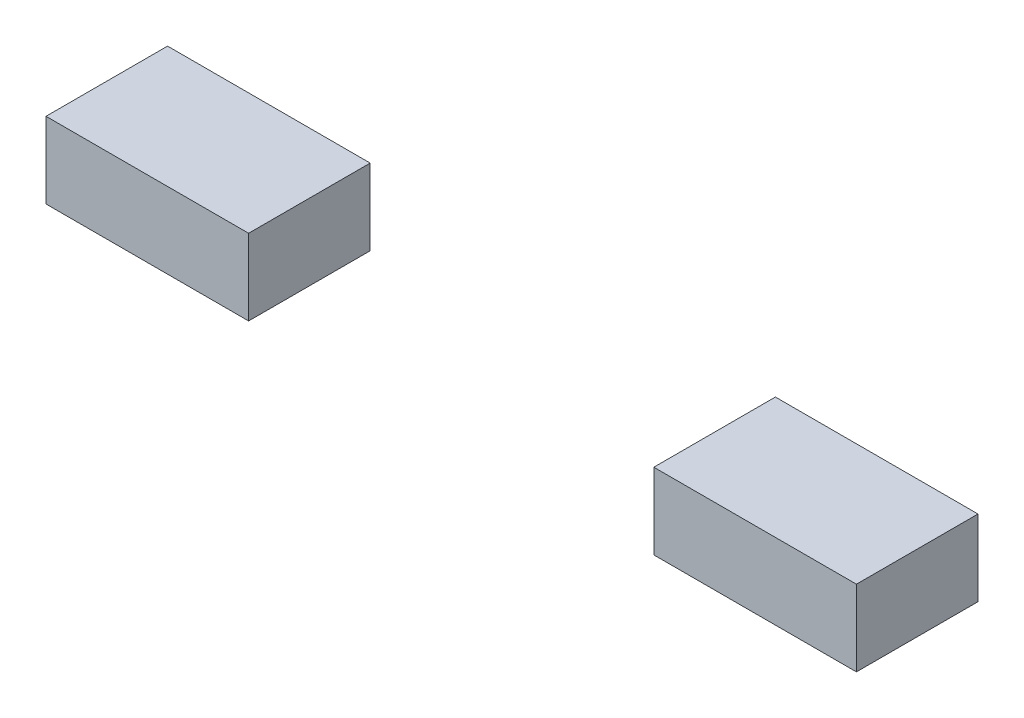
ISO-10303-21;
HEADER;
FILE_DESCRIPTION(('STEP AP214'),'2;1');
FILE_NAME('part.step','',(''),(''),'','','');
FILE_SCHEMA(('AUTOMOTIVE_DESIGN { 1 0 10303 214 1 1 1 1 }'));
ENDSEC;
DATA;
#1=APPLICATION_CONTEXT('core data for automotive mechanical design processes');
#2=APPLICATION_PROTOCOL_DEFINITION('international standard','automotive_design',2000,#1);
#3=PRODUCT_CONTEXT('',#1,'mechanical');
#4=PRODUCT('Part','Part','',(#3));
#5=PRODUCT_RELATED_PRODUCT_CATEGORY('part','',(#4));
#6=PRODUCT_DEFINITION_FORMATION('','',#4);
#7=PRODUCT_DEFINITION_CONTEXT('part definition',#1,'design');
#8=PRODUCT_DEFINITION('design','',#6,#7);
#9=PRODUCT_DEFINITION_SHAPE('','',#8);
#10=(LENGTH_UNIT() NAMED_UNIT(*) SI_UNIT(.MILLI.,.METRE.));
#11=(NAMED_UNIT(*) PLANE_ANGLE_UNIT() SI_UNIT($,.RADIAN.));
#12=(NAMED_UNIT(*) SI_UNIT($,.STERADIAN.) SOLID_ANGLE_UNIT());
#13=UNCERTAINTY_MEASURE_WITH_UNIT(LENGTH_MEASURE(1.E-05),#10,'distance_accuracy_value','');
#14=(GEOMETRIC_REPRESENTATION_CONTEXT(3) GLOBAL_UNCERTAINTY_ASSIGNED_CONTEXT((#13)) GLOBAL_UNIT_ASSIGNED_CONTEXT((#10,
#11,#12)) REPRESENTATION_CONTEXT('',''));
#15=CARTESIAN_POINT('',(0.,0.,0.));
#16=DIRECTION('',(0.,0.,1.));
#17=DIRECTION('',(1.,0.,0.));
#18=AXIS2_PLACEMENT_3D('',#15,#16,#17);
#19=CARTESIAN_POINT('',(-0.800000000000967,0.200000000000001,0.313815324665997));
#20=DIRECTION('',(0.,0.999999999999977,0.));
#21=DIRECTION('',(0.,0.,-1.));
#22=AXIS2_PLACEMENT_3D('',#19,#20,#21);
#23=PLANE('',#22);
#24=DIRECTION('',(0.,0.,-1.));
#25=VECTOR('',#24,1.);
#26=CARTESIAN_POINT('',(-0.400000000000483,0.199999999999999,0.156907662332999));
#27=LINE('',#26,#25);
#28=CARTESIAN_POINT('',(-0.400000000000483,0.199999999999999,0.260000000000003));
#29=VERTEX_POINT('',#28);
#30=CARTESIAN_POINT('',(-0.400000000000483,0.199999999999999,0.0199999999999992));
#31=VERTEX_POINT('',#30);
#32=EDGE_CURVE('P0_E20',#29,#31,#27,.T.);
#33=ORIENTED_EDGE('',*,*,#32,.F.);
#34=DIRECTION('',(0.999999999999977,0.,0.));
#35=VECTOR('',#34,1.);
#36=CARTESIAN_POINT('',(0.,0.20000000000006,0.260000000000003));
#37=LINE('',#36,#35);
#38=CARTESIAN_POINT('',(-0.800000000000967,0.200000000000001,0.260000000000003));
#39=VERTEX_POINT('',#38);
#40=EDGE_CURVE('P0_E27',#39,#29,#37,.T.);
#41=ORIENTED_EDGE('',*,*,#40,.F.);
#42=DIRECTION('',(0.,0.,1.));
#43=VECTOR('',#42,1.);
#44=CARTESIAN_POINT('',(-0.800000000000967,0.200000000000001,0.156907662332999));
#45=LINE('',#44,#43);
#46=CARTESIAN_POINT('',(-0.800000000000967,0.200000000000001,0.0199999999999992));
#47=VERTEX_POINT('',#46);
#48=EDGE_CURVE('P0_E11',#47,#39,#45,.T.);
#49=ORIENTED_EDGE('',*,*,#48,.F.);
#50=DIRECTION('',(-0.999999999999977,0.,0.));
#51=VECTOR('',#50,1.);
#52=CARTESIAN_POINT('',(0.,0.20000000000006,0.0199999999999992));
#53=LINE('',#52,#51);
#54=EDGE_CURVE('P0_E89',#31,#47,#53,.T.);
#55=ORIENTED_EDGE('',*,*,#54,.F.);
#56=EDGE_LOOP('',(#33,#41,#49,#55));
#57=FACE_BOUND('',#56,.T.);
#58=ADVANCED_FACE('P0_F16',(#57),#23,.F.);
#59=CARTESIAN_POINT('',(-0.800000000000967,0.39999999999994,0.));
#60=DIRECTION('',(-0.999999999999977,0.,0.));
#61=DIRECTION('',(0.,0.,1.));
#62=AXIS2_PLACEMENT_3D('',#59,#60,#61);
#63=PLANE('',#62);
#64=ORIENTED_EDGE('',*,*,#48,.T.);
#65=DIRECTION('',(0.,-0.999999999999977,0.));
#66=VECTOR('',#65,1.);
#67=CARTESIAN_POINT('',(-0.800000000000967,0.200000000000001,0.260000000000003));
#68=LINE('',#67,#66);
#69=CARTESIAN_POINT('',(-0.800000000000481,0.35,0.260000000000003));
#70=VERTEX_POINT('',#69);
#71=EDGE_CURVE('P0_E100',#70,#39,#68,.T.);
#72=ORIENTED_EDGE('',*,*,#71,.F.);
#73=DIRECTION('',(0.,0.,1.));
#74=VECTOR('',#73,1.);
#75=CARTESIAN_POINT('',(-0.800000000000481,0.35,0.));
#76=LINE('',#75,#74);
#77=CARTESIAN_POINT('',(-0.800000000000481,0.35,0.0199999999999992));
#78=VERTEX_POINT('',#77);
#79=EDGE_CURVE('P0_E56',#78,#70,#76,.T.);
#80=ORIENTED_EDGE('',*,*,#79,.F.);
#81=DIRECTION('',(0.,0.999999999999977,0.));
#82=VECTOR('',#81,1.);
#83=CARTESIAN_POINT('',(-0.800000000000009,0.271807033081939,0.0199999999999992));
#84=LINE('',#83,#82);
#85=EDGE_CURVE('P0_E92',#47,#78,#84,.T.);
#86=ORIENTED_EDGE('',*,*,#85,.F.);
#87=EDGE_LOOP('',(#64,#72,#80,#86));
#88=FACE_BOUND('',#87,.T.);
#89=ADVANCED_FACE('P0_F119',(#88),#63,.T.);
#90=CARTESIAN_POINT('',(0.799999999999038,0.364999999999999,0.260000000000003));
#91=DIRECTION('',(0.,0.,1.));
#92=DIRECTION('',(0.999999999999977,0.,0.));
#93=AXIS2_PLACEMENT_3D('',#90,#91,#92);
#94=PLANE('',#93);
#95=ORIENTED_EDGE('',*,*,#40,.T.);
#96=DIRECTION('',(0.,0.999999999999977,0.));
#97=VECTOR('',#96,1.);
#98=CARTESIAN_POINT('',(-0.399999999999998,0.434335309941939,0.260000000000003));
#99=LINE('',#98,#97);
#100=CARTESIAN_POINT('',(-0.399999999999998,0.349999999999941,0.260000000000003));
#101=VERTEX_POINT('',#100);
#102=EDGE_CURVE('P0_E103',#29,#101,#99,.T.);
#103=ORIENTED_EDGE('',*,*,#102,.T.);
#104=DIRECTION('',(0.999999999999977,0.,0.));
#105=VECTOR('',#104,1.);
#106=CARTESIAN_POINT('',(-0.700000000000006,0.349999999999941,0.260000000000003));
#107=LINE('',#106,#105);
#108=EDGE_CURVE('P0_E86',#70,#101,#107,.T.);
#109=ORIENTED_EDGE('',*,*,#108,.F.);
#110=ORIENTED_EDGE('',*,*,#71,.T.);
#111=EDGE_LOOP('',(#95,#103,#109,#110));
#112=FACE_BOUND('',#111,.T.);
#113=ADVANCED_FACE('P0_F117',(#112),#94,.T.);
#114=CARTESIAN_POINT('',(-0.400000000000011,0.503670619885,0.));
#115=DIRECTION('',(-0.999999999999977,0.,0.));
#116=DIRECTION('',(0.,0.,1.));
#117=AXIS2_PLACEMENT_3D('',#114,#115,#116);
#118=PLANE('',#117);
#119=ORIENTED_EDGE('',*,*,#32,.T.);
#120=DIRECTION('',(0.,-0.999999999999977,0.));
#121=VECTOR('',#120,1.);
#122=CARTESIAN_POINT('',(-0.400000000000969,0.32364234302394,0.0199999999999992));
#123=LINE('',#122,#121);
#124=CARTESIAN_POINT('',(-0.399999999999998,0.349999999999941,0.0199999999999992));
#125=VERTEX_POINT('',#124);
#126=EDGE_CURVE('P0_E74',#125,#31,#123,.T.);
#127=ORIENTED_EDGE('',*,*,#126,.F.);
#128=DIRECTION('',(0.,0.,1.));
#129=VECTOR('',#128,1.);
#130=CARTESIAN_POINT('',(-0.399999999999998,0.349999999999941,0.));
#131=LINE('',#130,#129);
#132=EDGE_CURVE('P0_E78',#125,#101,#131,.T.);
#133=ORIENTED_EDGE('',*,*,#132,.T.);
#134=ORIENTED_EDGE('',*,*,#102,.F.);
#135=EDGE_LOOP('',(#119,#127,#133,#134));
#136=FACE_BOUND('',#135,.T.);
#137=ADVANCED_FACE('P0_F76',(#136),#118,.F.);
#138=CARTESIAN_POINT('',(0.799999999999509,0.143614066163001,0.0199999999999992));
#139=DIRECTION('',(0.,0.,-1.));
#140=DIRECTION('',(0.,-0.999999999999977,0.));
#141=AXIS2_PLACEMENT_3D('',#138,#139,#140);
#142=PLANE('',#141);
#143=ORIENTED_EDGE('',*,*,#54,.T.);
#144=ORIENTED_EDGE('',*,*,#85,.T.);
#145=DIRECTION('',(0.999999999999977,0.,0.));
#146=VECTOR('',#145,1.);
#147=CARTESIAN_POINT('',(0.,0.349999999999939,0.0199999999999992));
#148=LINE('',#147,#146);
#149=EDGE_CURVE('P0_E83',#78,#125,#148,.T.);
#150=ORIENTED_EDGE('',*,*,#149,.T.);
#151=ORIENTED_EDGE('',*,*,#126,.T.);
#152=EDGE_LOOP('',(#143,#144,#150,#151));
#153=FACE_BOUND('',#152,.T.);
#154=ADVANCED_FACE('P0_F91',(#153),#142,.T.);
#155=CARTESIAN_POINT('',(-0.800000000000481,0.35,0.));
#156=DIRECTION('',(0.,-0.999999999999977,0.));
#157=DIRECTION('',(0.,0.,-1.));
#158=AXIS2_PLACEMENT_3D('',#155,#156,#157);
#159=PLANE('',#158);
#160=ORIENTED_EDGE('',*,*,#149,.F.);
#161=ORIENTED_EDGE('',*,*,#79,.T.);
#162=ORIENTED_EDGE('',*,*,#108,.T.);
#163=ORIENTED_EDGE('',*,*,#132,.F.);
#164=EDGE_LOOP('',(#160,#161,#162,#163));
#165=FACE_BOUND('',#164,.T.);
#166=ADVANCED_FACE('P0_F18',(#165),#159,.F.);
#167=CLOSED_SHELL('',(#58,#89,#113,#137,#154,#166));
#168=MANIFOLD_SOLID_BREP('P0_B1',#167);
#169=CARTESIAN_POINT('',(-0.800000000000439,0.35,0.));
#170=DIRECTION('',(0.,-0.999999999999979,0.));
#171=DIRECTION('',(0.,0.,-1.));
#172=AXIS2_PLACEMENT_3D('',#169,#170,#171);
#173=PLANE('',#172);
#174=DIRECTION('',(0.999999999999979,0.,0.));
#175=VECTOR('',#174,1.);
#176=CARTESIAN_POINT('',(0.,0.349999999999944,0.0199999999999992));
#177=LINE('',#176,#175);
#178=CARTESIAN_POINT('',(0.399999999999998,0.349999999999944,0.0199999999999992));
#179=VERTEX_POINT('',#178);
#180=CARTESIAN_POINT('',(0.799999999999551,0.35,0.0199999999999992));
#181=VERTEX_POINT('',#180);
#182=EDGE_CURVE('P1_E37',#179,#181,#177,.T.);
#183=ORIENTED_EDGE('',*,*,#182,.F.);
#184=DIRECTION('',(0.,0.,1.));
#185=VECTOR('',#184,1.);
#186=CARTESIAN_POINT('',(0.399999999999998,0.349999999999944,0.));
#187=LINE('',#186,#185);
#188=CARTESIAN_POINT('',(0.399999999999998,0.349999999999944,0.260000000000003));
#189=VERTEX_POINT('',#188);
#190=EDGE_CURVE('P1_E11',#179,#189,#187,.T.);
#191=ORIENTED_EDGE('',*,*,#190,.T.);
#192=DIRECTION('',(0.999999999999979,0.,0.));
#193=VECTOR('',#192,1.);
#194=CARTESIAN_POINT('',(-0.100000000000003,0.349999999999944,0.260000000000003));
#195=LINE('',#194,#193);
#196=CARTESIAN_POINT('',(0.799999999999551,0.35,0.260000000000003));
#197=VERTEX_POINT('',#196);
#198=EDGE_CURVE('P1_E20',#189,#197,#195,.T.);
#199=ORIENTED_EDGE('',*,*,#198,.T.);
#200=DIRECTION('',(0.,0.,-1.));
#201=VECTOR('',#200,1.);
#202=CARTESIAN_POINT('',(0.799999999999551,0.35,0.));
#203=LINE('',#202,#201);
#204=EDGE_CURVE('P1_E90',#197,#181,#203,.T.);
#205=ORIENTED_EDGE('',*,*,#204,.T.);
#206=EDGE_LOOP('',(#183,#191,#199,#205));
#207=FACE_BOUND('',#206,.T.);
#208=ADVANCED_FACE('P1_F16',(#207),#173,.F.);
#209=CARTESIAN_POINT('',(0.799999999999551,0.143614066163001,0.0199999999999992));
#210=DIRECTION('',(0.,0.,-1.));
#211=DIRECTION('',(0.,-0.999999999999979,0.));
#212=AXIS2_PLACEMENT_3D('',#209,#210,#211);
#213=PLANE('',#212);
#214=DIRECTION('',(-0.999999999999979,0.,0.));
#215=VECTOR('',#214,1.);
#216=CARTESIAN_POINT('',(0.,0.200000000000054,0.0199999999999992));
#217=LINE('',#216,#215);
#218=CARTESIAN_POINT('',(0.799999999999551,0.199999999999945,0.0199999999999992));
#219=VERTEX_POINT('',#218);
#220=CARTESIAN_POINT('',(0.399999999999998,0.199999999999999,0.0199999999999992));
#221=VERTEX_POINT('',#220);
#222=EDGE_CURVE('P1_E75',#219,#221,#217,.T.);
#223=ORIENTED_EDGE('',*,*,#222,.T.);
#224=DIRECTION('',(0.,0.999999999999979,0.));
#225=VECTOR('',#224,1.);
#226=CARTESIAN_POINT('',(0.399999999999998,-0.180028276861055,0.0199999999999992));
#227=LINE('',#226,#225);
#228=EDGE_CURVE('P1_E91',#221,#179,#227,.T.);
#229=ORIENTED_EDGE('',*,*,#228,.T.);
#230=ORIENTED_EDGE('',*,*,#182,.T.);
#231=DIRECTION('',(0.,-0.999999999999979,0.));
#232=VECTOR('',#231,1.);
#233=CARTESIAN_POINT('',(0.799999999999565,-0.128192966918055,0.0199999999999992));
#234=LINE('',#233,#232);
#235=EDGE_CURVE('P1_E72',#181,#219,#234,.T.);
#236=ORIENTED_EDGE('',*,*,#235,.T.);
#237=EDGE_LOOP('',(#223,#229,#230,#236));
#238=FACE_BOUND('',#237,.T.);
#239=ADVANCED_FACE('P1_F18',(#238),#213,.T.);
#240=CARTESIAN_POINT('',(0.799999999999551,-0.400000000000001,0.));
#241=DIRECTION('',(0.999999999999979,0.,0.));
#242=DIRECTION('',(0.,0.999999999999979,0.));
#243=AXIS2_PLACEMENT_3D('',#240,#241,#242);
#244=PLANE('',#243);
#245=DIRECTION('',(0.,0.,-1.));
#246=VECTOR('',#245,1.);
#247=CARTESIAN_POINT('',(0.799999999999551,0.199999999999945,0.156907662332999));
#248=LINE('',#247,#246);
#249=CARTESIAN_POINT('',(0.799999999999551,0.199999999999945,0.260000000000003));
#250=VERTEX_POINT('',#249);
#251=EDGE_CURVE('P1_E80',#250,#219,#248,.T.);
#252=ORIENTED_EDGE('',*,*,#251,.T.);
#253=ORIENTED_EDGE('',*,*,#235,.F.);
#254=ORIENTED_EDGE('',*,*,#204,.F.);
#255=DIRECTION('',(0.,0.999999999999979,0.));
#256=VECTOR('',#255,1.);
#257=CARTESIAN_POINT('',(0.799999999999551,-0.200000000000056,0.260000000000003));
#258=LINE('',#257,#256);
#259=EDGE_CURVE('P1_E94',#250,#197,#258,.T.);
#260=ORIENTED_EDGE('',*,*,#259,.F.);
#261=EDGE_LOOP('',(#252,#253,#254,#260));
#262=FACE_BOUND('',#261,.T.);
#263=ADVANCED_FACE('P1_F93',(#262),#244,.T.);
#264=CARTESIAN_POINT('',(0.799999999999121,0.364999999999999,0.260000000000003));
#265=DIRECTION('',(0.,0.,1.));
#266=DIRECTION('',(0.999999999999979,0.,0.));
#267=AXIS2_PLACEMENT_3D('',#264,#265,#266);
#268=PLANE('',#267);
#269=DIRECTION('',(0.999999999999979,0.,0.));
#270=VECTOR('',#269,1.);
#271=CARTESIAN_POINT('',(0.,0.200000000000054,0.260000000000003));
#272=LINE('',#271,#270);
#273=CARTESIAN_POINT('',(0.399999999999998,0.200000000000001,0.260000000000003));
#274=VERTEX_POINT('',#273);
#275=EDGE_CURVE('P1_E96',#274,#250,#272,.T.);
#276=ORIENTED_EDGE('',*,*,#275,.T.);
#277=ORIENTED_EDGE('',*,*,#259,.T.);
#278=ORIENTED_EDGE('',*,*,#198,.F.);
#279=DIRECTION('',(0.,-0.999999999999979,0.));
#280=VECTOR('',#279,1.);
#281=CARTESIAN_POINT('',(0.399999999999998,-0.06933530994244,0.260000000000003));
#282=LINE('',#281,#280);
#283=EDGE_CURVE('P1_E103',#189,#274,#282,.T.);
#284=ORIENTED_EDGE('',*,*,#283,.T.);
#285=EDGE_LOOP('',(#276,#277,#278,#284));
#286=FACE_BOUND('',#285,.T.);
#287=ADVANCED_FACE('P1_F152',(#286),#268,.T.);
#288=CARTESIAN_POINT('',(0.399999999999123,-0.503670619884945,0.));
#289=DIRECTION('',(0.999999999999979,0.,0.));
#290=DIRECTION('',(0.,0.999999999999979,0.));
#291=AXIS2_PLACEMENT_3D('',#288,#289,#290);
#292=PLANE('',#291);
#293=DIRECTION('',(0.,0.,1.));
#294=VECTOR('',#293,1.);
#295=CARTESIAN_POINT('',(0.399999999999998,0.199999999999999,0.156907662332999));
#296=LINE('',#295,#294);
#297=EDGE_CURVE('P1_E88',#221,#274,#296,.T.);
#298=ORIENTED_EDGE('',*,*,#297,.T.);
#299=ORIENTED_EDGE('',*,*,#283,.F.);
#300=ORIENTED_EDGE('',*,*,#190,.F.);
#301=ORIENTED_EDGE('',*,*,#228,.F.);
#302=EDGE_LOOP('',(#298,#299,#300,#301));
#303=FACE_BOUND('',#302,.T.);
#304=ADVANCED_FACE('P1_F147',(#303),#292,.F.);
#305=CARTESIAN_POINT('',(-0.800000000000883,0.200000000000001,0.313815324665997));
#306=DIRECTION('',(0.,0.999999999999979,0.));
#307=DIRECTION('',(0.,0.,-1.));
#308=AXIS2_PLACEMENT_3D('',#305,#306,#307);
#309=PLANE('',#308);
#310=ORIENTED_EDGE('',*,*,#251,.F.);
#311=ORIENTED_EDGE('',*,*,#275,.F.);
#312=ORIENTED_EDGE('',*,*,#297,.F.);
#313=ORIENTED_EDGE('',*,*,#222,.F.);
#314=EDGE_LOOP('',(#310,#311,#312,#313));
#315=FACE_BOUND('',#314,.T.);
#316=ADVANCED_FACE('P1_F84',(#315),#309,.F.);
#317=CLOSED_SHELL('',(#208,#239,#263,#287,#304,#316));
#318=MANIFOLD_SOLID_BREP('P1_B1',#317);
#319=ADVANCED_BREP_SHAPE_REPRESENTATION('',(#18,#168,#318),#14);
#320=SHAPE_DEFINITION_REPRESENTATION(#9,#319);
ENDSEC;
END-ISO-10303-21;
